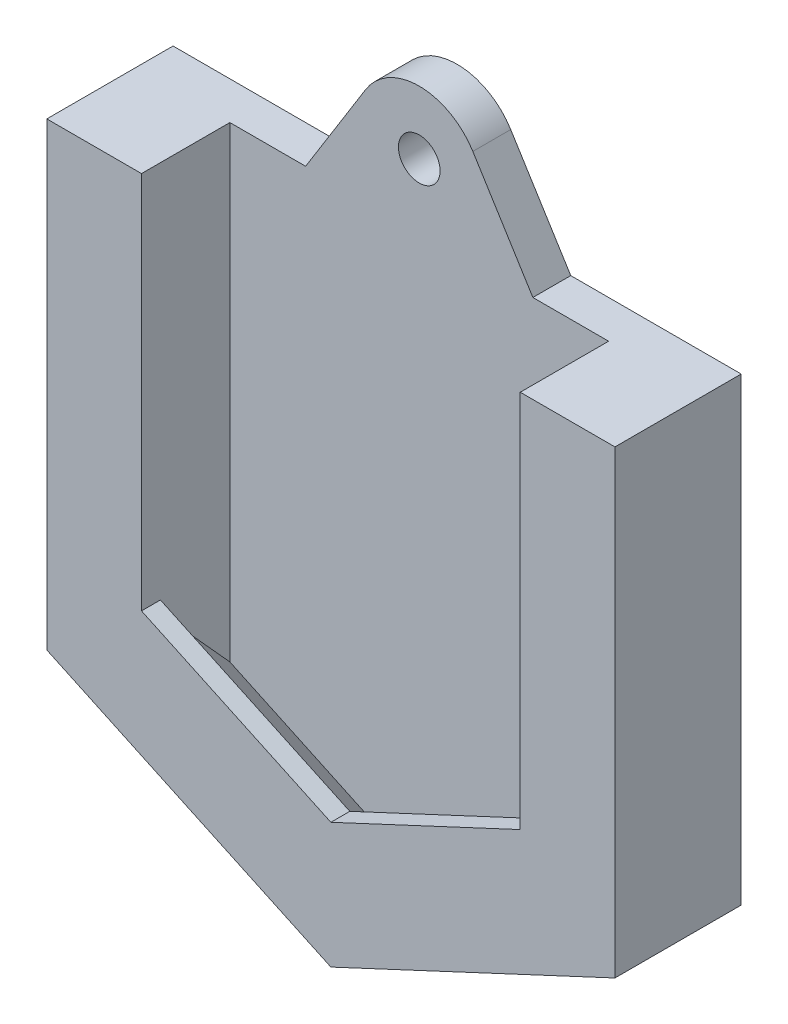
ISO-10303-21;
HEADER;
FILE_DESCRIPTION(('STEP AP214'),'2;1');
FILE_NAME('part.step','',(''),(''),'','','');
FILE_SCHEMA(('AUTOMOTIVE_DESIGN { 1 0 10303 214 1 1 1 1 }'));
ENDSEC;
DATA;
#1=APPLICATION_CONTEXT('core data for automotive mechanical design processes');
#2=APPLICATION_PROTOCOL_DEFINITION('international standard','automotive_design',2000,#1);
#3=PRODUCT_CONTEXT('',#1,'mechanical');
#4=PRODUCT('Part','Part','',(#3));
#5=PRODUCT_RELATED_PRODUCT_CATEGORY('part','',(#4));
#6=PRODUCT_DEFINITION_FORMATION('','',#4);
#7=PRODUCT_DEFINITION_CONTEXT('part definition',#1,'design');
#8=PRODUCT_DEFINITION('design','',#6,#7);
#9=PRODUCT_DEFINITION_SHAPE('','',#8);
#10=(LENGTH_UNIT() NAMED_UNIT(*) SI_UNIT(.MILLI.,.METRE.));
#11=(NAMED_UNIT(*) PLANE_ANGLE_UNIT() SI_UNIT($,.RADIAN.));
#12=(NAMED_UNIT(*) SI_UNIT($,.STERADIAN.) SOLID_ANGLE_UNIT());
#13=UNCERTAINTY_MEASURE_WITH_UNIT(LENGTH_MEASURE(1.E-05),#10,'distance_accuracy_value','');
#14=(GEOMETRIC_REPRESENTATION_CONTEXT(3) GLOBAL_UNCERTAINTY_ASSIGNED_CONTEXT((#13)) GLOBAL_UNIT_ASSIGNED_CONTEXT((#10,
#11,#12)) REPRESENTATION_CONTEXT('',''));
#15=CARTESIAN_POINT('',(0.,0.,0.));
#16=DIRECTION('',(0.,0.,1.));
#17=DIRECTION('',(1.,0.,0.));
#18=AXIS2_PLACEMENT_3D('',#15,#16,#17);
#19=CARTESIAN_POINT('',(-22.5,25.,10.));
#20=DIRECTION('',(0.,-1.,0.));
#21=DIRECTION('',(0.,0.,-1.));
#22=AXIS2_PLACEMENT_3D('',#19,#20,#21);
#23=PLANE('',#22);
#24=DIRECTION('',(0.,0.,-1.));
#25=VECTOR('',#24,1.);
#26=CARTESIAN_POINT('',(9.,25.,3.));
#27=LINE('',#26,#25);
#28=CARTESIAN_POINT('',(9.,25.,3.));
#29=VERTEX_POINT('',#28);
#30=CARTESIAN_POINT('',(9.,25.,0.));
#31=VERTEX_POINT('',#30);
#32=EDGE_CURVE('E314',#29,#31,#27,.T.);
#33=ORIENTED_EDGE('',*,*,#32,.F.);
#34=DIRECTION('',(-1.,0.,0.));
#35=VECTOR('',#34,1.);
#36=CARTESIAN_POINT('',(-15.,25.,3.));
#37=LINE('',#36,#35);
#38=CARTESIAN_POINT('',(15.,25.,3.));
#39=VERTEX_POINT('',#38);
#40=EDGE_CURVE('E224',#39,#29,#37,.T.);
#41=ORIENTED_EDGE('',*,*,#40,.F.);
#42=DIRECTION('',(0.,0.,1.));
#43=VECTOR('',#42,1.);
#44=CARTESIAN_POINT('',(15.,25.,3.));
#45=LINE('',#44,#43);
#46=CARTESIAN_POINT('',(15.,25.,10.));
#47=VERTEX_POINT('',#46);
#48=EDGE_CURVE('E223',#39,#47,#45,.T.);
#49=ORIENTED_EDGE('',*,*,#48,.T.);
#50=DIRECTION('',(-1.,0.,0.));
#51=VECTOR('',#50,1.);
#52=CARTESIAN_POINT('',(-22.5,25.,10.));
#53=LINE('',#52,#51);
#54=CARTESIAN_POINT('',(22.5,25.,10.));
#55=VERTEX_POINT('',#54);
#56=EDGE_CURVE('E264',#55,#47,#53,.T.);
#57=ORIENTED_EDGE('',*,*,#56,.F.);
#58=DIRECTION('',(0.,0.,-1.));
#59=VECTOR('',#58,1.);
#60=CARTESIAN_POINT('',(22.5,25.,10.));
#61=LINE('',#60,#59);
#62=CARTESIAN_POINT('',(22.5,25.,0.));
#63=VERTEX_POINT('',#62);
#64=EDGE_CURVE('E192',#55,#63,#61,.T.);
#65=ORIENTED_EDGE('',*,*,#64,.T.);
#66=DIRECTION('',(-1.,0.,0.));
#67=VECTOR('',#66,1.);
#68=CARTESIAN_POINT('',(-22.5,25.,0.));
#69=LINE('',#68,#67);
#70=EDGE_CURVE('E174',#63,#31,#69,.T.);
#71=ORIENTED_EDGE('',*,*,#70,.T.);
#72=EDGE_LOOP('',(#33,#41,#49,#57,#65,#71));
#73=FACE_BOUND('',#72,.T.);
#74=ADVANCED_FACE('F33',(#73),#23,.F.);
#75=CARTESIAN_POINT('',(22.5,25.,10.));
#76=DIRECTION('',(-1.,0.,0.));
#77=DIRECTION('',(0.,-1.,0.));
#78=AXIS2_PLACEMENT_3D('',#75,#76,#77);
#79=PLANE('',#78);
#80=DIRECTION('',(0.,1.,0.));
#81=VECTOR('',#80,1.);
#82=CARTESIAN_POINT('',(22.5,25.,10.));
#83=LINE('',#82,#81);
#84=CARTESIAN_POINT('',(22.5,-11.4317672143481,10.));
#85=VERTEX_POINT('',#84);
#86=EDGE_CURVE('E168',#85,#55,#83,.T.);
#87=ORIENTED_EDGE('',*,*,#86,.F.);
#88=DIRECTION('',(0.,0.,1.));
#89=VECTOR('',#88,1.);
#90=CARTESIAN_POINT('',(22.5,-11.4317672143481,0.));
#91=LINE('',#90,#89);
#92=CARTESIAN_POINT('',(22.5,-11.4317672143481,0.));
#93=VERTEX_POINT('',#92);
#94=EDGE_CURVE('E155',#93,#85,#91,.T.);
#95=ORIENTED_EDGE('',*,*,#94,.F.);
#96=DIRECTION('',(0.,1.,0.));
#97=VECTOR('',#96,1.);
#98=CARTESIAN_POINT('',(22.5,25.,0.));
#99=LINE('',#98,#97);
#100=EDGE_CURVE('E166',#93,#63,#99,.T.);
#101=ORIENTED_EDGE('',*,*,#100,.T.);
#102=ORIENTED_EDGE('',*,*,#64,.F.);
#103=EDGE_LOOP('',(#87,#95,#101,#102));
#104=FACE_BOUND('',#103,.T.);
#105=ADVANCED_FACE('F164',(#104),#79,.F.);
#106=CARTESIAN_POINT('',(-9.,25.,3.));
#107=VERTEX_POINT('',#106);
#108=CARTESIAN_POINT('',(-15.,25.,3.));
#109=VERTEX_POINT('',#108);
#110=EDGE_CURVE('E222',#107,#109,#37,.T.);
#111=ORIENTED_EDGE('',*,*,#110,.F.);
#112=DIRECTION('',(0.,0.,-1.));
#113=VECTOR('',#112,1.);
#114=CARTESIAN_POINT('',(-9.,25.,3.));
#115=LINE('',#114,#113);
#116=CARTESIAN_POINT('',(-9.,25.,0.));
#117=VERTEX_POINT('',#116);
#118=EDGE_CURVE('E312',#107,#117,#115,.T.);
#119=ORIENTED_EDGE('',*,*,#118,.T.);
#120=CARTESIAN_POINT('',(-22.5,25.,0.));
#121=VERTEX_POINT('',#120);
#122=EDGE_CURVE('E176',#117,#121,#69,.T.);
#123=ORIENTED_EDGE('',*,*,#122,.T.);
#124=DIRECTION('',(0.,0.,-1.));
#125=VECTOR('',#124,1.);
#126=CARTESIAN_POINT('',(-22.5,25.,10.));
#127=LINE('',#126,#125);
#128=CARTESIAN_POINT('',(-22.5,25.,10.));
#129=VERTEX_POINT('',#128);
#130=EDGE_CURVE('E189',#129,#121,#127,.T.);
#131=ORIENTED_EDGE('',*,*,#130,.F.);
#132=CARTESIAN_POINT('',(-15.,25.,10.));
#133=VERTEX_POINT('',#132);
#134=EDGE_CURVE('E263',#133,#129,#53,.T.);
#135=ORIENTED_EDGE('',*,*,#134,.F.);
#136=DIRECTION('',(0.,0.,1.));
#137=VECTOR('',#136,1.);
#138=CARTESIAN_POINT('',(-15.,25.,3.));
#139=LINE('',#138,#137);
#140=EDGE_CURVE('E259',#109,#133,#139,.T.);
#141=ORIENTED_EDGE('',*,*,#140,.F.);
#142=EDGE_LOOP('',(#111,#119,#123,#131,#135,#141));
#143=FACE_BOUND('',#142,.T.);
#144=ADVANCED_FACE('F278',(#143),#23,.F.);
#145=CARTESIAN_POINT('',(-22.5,25.,10.));
#146=DIRECTION('',(1.,0.,0.));
#147=DIRECTION('',(0.,1.,0.));
#148=AXIS2_PLACEMENT_3D('',#145,#146,#147);
#149=PLANE('',#148);
#150=DIRECTION('',(0.,-1.,0.));
#151=VECTOR('',#150,1.);
#152=CARTESIAN_POINT('',(-22.5,25.,0.));
#153=LINE('',#152,#151);
#154=CARTESIAN_POINT('',(-22.5,-11.4317672143481,0.));
#155=VERTEX_POINT('',#154);
#156=EDGE_CURVE('E186',#121,#155,#153,.T.);
#157=ORIENTED_EDGE('',*,*,#156,.T.);
#158=DIRECTION('',(0.,0.,1.));
#159=VECTOR('',#158,1.);
#160=CARTESIAN_POINT('',(-22.5,-11.4317672143481,0.));
#161=LINE('',#160,#159);
#162=CARTESIAN_POINT('',(-22.5,-11.4317672143481,10.));
#163=VERTEX_POINT('',#162);
#164=EDGE_CURVE('E284',#155,#163,#161,.T.);
#165=ORIENTED_EDGE('',*,*,#164,.T.);
#166=DIRECTION('',(0.,-1.,0.));
#167=VECTOR('',#166,1.);
#168=CARTESIAN_POINT('',(-22.5,25.,10.));
#169=LINE('',#168,#167);
#170=EDGE_CURVE('E183',#129,#163,#169,.T.);
#171=ORIENTED_EDGE('',*,*,#170,.F.);
#172=ORIENTED_EDGE('',*,*,#130,.T.);
#173=EDGE_LOOP('',(#157,#165,#171,#172));
#174=FACE_BOUND('',#173,.T.);
#175=ADVANCED_FACE('F283',(#174),#149,.F.);
#176=CARTESIAN_POINT('',(0.,0.,10.));
#177=DIRECTION('',(0.,0.,1.));
#178=DIRECTION('',(1.,0.,0.));
#179=AXIS2_PLACEMENT_3D('',#176,#177,#178);
#180=PLANE('',#179);
#181=DIRECTION('',(-0.906183139995265,0.422885465331124,0.));
#182=VECTOR('',#181,1.);
#183=CARTESIAN_POINT('',(-22.5,-11.4317672143481,10.));
#184=LINE('',#183,#182);
#185=CARTESIAN_POINT('',(0.,-21.9317672143481,10.));
#186=VERTEX_POINT('',#185);
#187=EDGE_CURVE('E160',#186,#163,#184,.T.);
#188=ORIENTED_EDGE('',*,*,#187,.F.);
#189=DIRECTION('',(-0.906183139995265,-0.422885465331124,0.));
#190=VECTOR('',#189,1.);
#191=CARTESIAN_POINT('',(0.,-21.9317672143481,10.));
#192=LINE('',#191,#190);
#193=EDGE_CURVE('E338',#85,#186,#192,.T.);
#194=ORIENTED_EDGE('',*,*,#193,.F.);
#195=ORIENTED_EDGE('',*,*,#86,.T.);
#196=ORIENTED_EDGE('',*,*,#56,.T.);
#197=DIRECTION('',(0.,1.,0.));
#198=VECTOR('',#197,1.);
#199=CARTESIAN_POINT('',(15.,-5.,10.));
#200=LINE('',#199,#198);
#201=CARTESIAN_POINT('',(15.,-5.,10.));
#202=VERTEX_POINT('',#201);
#203=EDGE_CURVE('E240',#202,#47,#200,.T.);
#204=ORIENTED_EDGE('',*,*,#203,.F.);
#205=DIRECTION('',(0.906183139995265,0.422885465331124,0.));
#206=VECTOR('',#205,1.);
#207=CARTESIAN_POINT('',(0.,-12.,10.));
#208=LINE('',#207,#206);
#209=CARTESIAN_POINT('',(0.,-12.,10.));
#210=VERTEX_POINT('',#209);
#211=EDGE_CURVE('E244',#210,#202,#208,.T.);
#212=ORIENTED_EDGE('',*,*,#211,.F.);
#213=DIRECTION('',(0.906183139995265,-0.422885465331124,0.));
#214=VECTOR('',#213,1.);
#215=CARTESIAN_POINT('',(-15.,-5.,10.));
#216=LINE('',#215,#214);
#217=CARTESIAN_POINT('',(-15.,-5.,10.));
#218=VERTEX_POINT('',#217);
#219=EDGE_CURVE('E251',#218,#210,#216,.T.);
#220=ORIENTED_EDGE('',*,*,#219,.F.);
#221=DIRECTION('',(0.,-1.,0.));
#222=VECTOR('',#221,1.);
#223=CARTESIAN_POINT('',(-15.,-5.,10.));
#224=LINE('',#223,#222);
#225=EDGE_CURVE('E248',#133,#218,#224,.T.);
#226=ORIENTED_EDGE('',*,*,#225,.F.);
#227=ORIENTED_EDGE('',*,*,#134,.T.);
#228=ORIENTED_EDGE('',*,*,#170,.T.);
#229=EDGE_LOOP('',(#188,#194,#195,#196,#204,#212,#220,#226,#227,#228));
#230=FACE_BOUND('',#229,.T.);
#231=ADVANCED_FACE('F274',(#230),#180,.T.);
#232=CARTESIAN_POINT('',(0.,0.,0.));
#233=DIRECTION('',(0.,0.,1.));
#234=DIRECTION('',(1.,0.,0.));
#235=AXIS2_PLACEMENT_3D('',#232,#233,#234);
#236=PLANE('',#235);
#237=DIRECTION('',(-0.906183139995265,-0.422885465331124,0.));
#238=VECTOR('',#237,1.);
#239=CARTESIAN_POINT('',(0.,-21.9317672143481,0.));
#240=LINE('',#239,#238);
#241=CARTESIAN_POINT('',(0.,-21.9317672143481,0.));
#242=VERTEX_POINT('',#241);
#243=EDGE_CURVE('E151',#93,#242,#240,.T.);
#244=ORIENTED_EDGE('',*,*,#243,.T.);
#245=DIRECTION('',(-0.906183139995265,0.422885465331124,0.));
#246=VECTOR('',#245,1.);
#247=CARTESIAN_POINT('',(-22.5,-11.4317672143481,0.));
#248=LINE('',#247,#246);
#249=EDGE_CURVE('E49',#242,#155,#248,.T.);
#250=ORIENTED_EDGE('',*,*,#249,.T.);
#251=ORIENTED_EDGE('',*,*,#156,.F.);
#252=ORIENTED_EDGE('',*,*,#122,.F.);
#253=DIRECTION('',(0.528301886792453,0.849056603773585,0.));
#254=VECTOR('',#253,1.);
#255=CARTESIAN_POINT('',(-4.24528301886792,32.6415094339623,0.));
#256=LINE('',#255,#254);
#257=CARTESIAN_POINT('',(-4.24528301886792,32.6415094339623,0.));
#258=VERTEX_POINT('',#257);
#259=EDGE_CURVE('E57',#117,#258,#256,.T.);
#260=ORIENTED_EDGE('',*,*,#259,.T.);
#261=CARTESIAN_POINT('',(0.,30.,0.));
#262=DIRECTION('',(0.,0.,-1.));
#263=DIRECTION('',(-1.,0.,0.));
#264=AXIS2_PLACEMENT_3D('',#261,#262,#263);
#265=CIRCLE('',#264,5.);
#266=CARTESIAN_POINT('',(4.24528301886792,32.6415094339623,0.));
#267=VERTEX_POINT('',#266);
#268=EDGE_CURVE('E295',#258,#267,#265,.T.);
#269=ORIENTED_EDGE('',*,*,#268,.T.);
#270=DIRECTION('',(0.528301886792453,-0.849056603773585,0.));
#271=VECTOR('',#270,1.);
#272=CARTESIAN_POINT('',(9.,25.,0.));
#273=LINE('',#272,#271);
#274=EDGE_CURVE('E308',#267,#31,#273,.T.);
#275=ORIENTED_EDGE('',*,*,#274,.T.);
#276=ORIENTED_EDGE('',*,*,#70,.F.);
#277=ORIENTED_EDGE('',*,*,#100,.F.);
#278=EDGE_LOOP('',(#244,#250,#251,#252,#260,#269,#275,#276,#277));
#279=FACE_BOUND('',#278,.T.);
#280=CARTESIAN_POINT('',(0.,30.,0.));
#281=DIRECTION('',(0.,0.,-1.));
#282=DIRECTION('',(-1.,0.,0.));
#283=AXIS2_PLACEMENT_3D('',#280,#281,#282);
#284=CIRCLE('',#283,1.65);
#285=CARTESIAN_POINT('',(-1.65,30.,0.));
#286=VERTEX_POINT('',#285);
#287=EDGE_CURVE('E285',#286,#286,#284,.T.);
#288=ORIENTED_EDGE('',*,*,#287,.F.);
#289=EDGE_LOOP('',(#288));
#290=FACE_BOUND('',#289,.T.);
#291=ADVANCED_FACE('F170',(#279,#290),#236,.F.);
#292=CARTESIAN_POINT('',(15.,-5.,3.));
#293=DIRECTION('',(1.,0.,0.));
#294=DIRECTION('',(0.,0.,-1.));
#295=AXIS2_PLACEMENT_3D('',#292,#293,#294);
#296=PLANE('',#295);
#297=DIRECTION('',(0.,1.,0.));
#298=VECTOR('',#297,1.);
#299=CARTESIAN_POINT('',(15.,-5.,3.));
#300=LINE('',#299,#298);
#301=CARTESIAN_POINT('',(15.,-12.,3.));
#302=VERTEX_POINT('',#301);
#303=EDGE_CURVE('E241',#302,#39,#300,.T.);
#304=ORIENTED_EDGE('',*,*,#303,.F.);
#305=DIRECTION('',(0.,0.741011603413051,0.671492221553772));
#306=VECTOR('',#305,1.);
#307=CARTESIAN_POINT('',(15.,-15.8436873747495,-0.483084694410695));
#308=LINE('',#307,#306);
#309=CARTESIAN_POINT('',(15.,-5.93058670234285,8.5));
#310=VERTEX_POINT('',#309);
#311=EDGE_CURVE('E11',#302,#310,#308,.T.);
#312=ORIENTED_EDGE('',*,*,#311,.T.);
#313=DIRECTION('',(0.,1.,0.));
#314=VECTOR('',#313,1.);
#315=CARTESIAN_POINT('',(15.,-12.,8.5));
#316=LINE('',#315,#314);
#317=CARTESIAN_POINT('',(15.,-5.,8.5));
#318=VERTEX_POINT('',#317);
#319=EDGE_CURVE('E234',#310,#318,#316,.T.);
#320=ORIENTED_EDGE('',*,*,#319,.T.);
#321=DIRECTION('',(0.,0.,1.));
#322=VECTOR('',#321,1.);
#323=CARTESIAN_POINT('',(15.,-5.,3.));
#324=LINE('',#323,#322);
#325=EDGE_CURVE('E177',#318,#202,#324,.T.);
#326=ORIENTED_EDGE('',*,*,#325,.T.);
#327=ORIENTED_EDGE('',*,*,#203,.T.);
#328=ORIENTED_EDGE('',*,*,#48,.F.);
#329=EDGE_LOOP('',(#304,#312,#320,#326,#327,#328));
#330=FACE_BOUND('',#329,.T.);
#331=ADVANCED_FACE('F319',(#330),#296,.F.);
#332=CARTESIAN_POINT('',(0.,-12.,3.));
#333=DIRECTION('',(0.422885465331124,-0.906183139995266,0.));
#334=DIRECTION('',(0.906183139995266,0.422885465331124,0.));
#335=AXIS2_PLACEMENT_3D('',#332,#333,#334);
#336=PLANE('',#335);
#337=ORIENTED_EDGE('',*,*,#325,.F.);
#338=DIRECTION('',(-0.906183139995266,-0.422885465331124,0.));
#339=VECTOR('',#338,1.);
#340=CARTESIAN_POINT('',(0.,-12.,8.5));
#341=LINE('',#340,#339);
#342=CARTESIAN_POINT('',(0.,-12.,8.5));
#343=VERTEX_POINT('',#342);
#344=EDGE_CURVE('E237',#318,#343,#341,.T.);
#345=ORIENTED_EDGE('',*,*,#344,.T.);
#346=DIRECTION('',(0.,0.,1.));
#347=VECTOR('',#346,1.);
#348=CARTESIAN_POINT('',(0.,-12.,3.));
#349=LINE('',#348,#347);
#350=EDGE_CURVE('E180',#343,#210,#349,.T.);
#351=ORIENTED_EDGE('',*,*,#350,.T.);
#352=ORIENTED_EDGE('',*,*,#211,.T.);
#353=EDGE_LOOP('',(#337,#345,#351,#352));
#354=FACE_BOUND('',#353,.T.);
#355=ADVANCED_FACE('F327',(#354),#336,.F.);
#356=CARTESIAN_POINT('',(-15.,-5.,3.));
#357=DIRECTION('',(-0.422885465331124,-0.906183139995265,0.));
#358=DIRECTION('',(0.906183139995266,-0.422885465331124,0.));
#359=AXIS2_PLACEMENT_3D('',#356,#357,#358);
#360=PLANE('',#359);
#361=ORIENTED_EDGE('',*,*,#350,.F.);
#362=DIRECTION('',(-0.906183139995266,0.422885465331124,0.));
#363=VECTOR('',#362,1.);
#364=CARTESIAN_POINT('',(-15.,-5.,8.5));
#365=LINE('',#364,#363);
#366=CARTESIAN_POINT('',(-15.,-5.,8.5));
#367=VERTEX_POINT('',#366);
#368=EDGE_CURVE('E194',#343,#367,#365,.T.);
#369=ORIENTED_EDGE('',*,*,#368,.T.);
#370=DIRECTION('',(0.,0.,1.));
#371=VECTOR('',#370,1.);
#372=CARTESIAN_POINT('',(-15.,-5.,3.));
#373=LINE('',#372,#371);
#374=EDGE_CURVE('E257',#367,#218,#373,.T.);
#375=ORIENTED_EDGE('',*,*,#374,.T.);
#376=ORIENTED_EDGE('',*,*,#219,.T.);
#377=EDGE_LOOP('',(#361,#369,#375,#376));
#378=FACE_BOUND('',#377,.T.);
#379=ADVANCED_FACE('F336',(#378),#360,.F.);
#380=CARTESIAN_POINT('',(-15.,-5.,3.));
#381=DIRECTION('',(-1.,0.,0.));
#382=DIRECTION('',(0.,0.,1.));
#383=AXIS2_PLACEMENT_3D('',#380,#381,#382);
#384=PLANE('',#383);
#385=DIRECTION('',(0.,-1.,0.));
#386=VECTOR('',#385,1.);
#387=CARTESIAN_POINT('',(-15.,-5.,8.5));
#388=LINE('',#387,#386);
#389=CARTESIAN_POINT('',(-15.,-5.93058670234284,8.5));
#390=VERTEX_POINT('',#389);
#391=EDGE_CURVE('E210',#367,#390,#388,.T.);
#392=ORIENTED_EDGE('',*,*,#391,.T.);
#393=DIRECTION('',(0.,-0.741011603413051,-0.671492221553771));
#394=VECTOR('',#393,1.);
#395=CARTESIAN_POINT('',(-15.,-12.,2.99999999999997));
#396=LINE('',#395,#394);
#397=CARTESIAN_POINT('',(-15.,-12.,3.));
#398=VERTEX_POINT('',#397);
#399=EDGE_CURVE('E42',#390,#398,#396,.T.);
#400=ORIENTED_EDGE('',*,*,#399,.T.);
#401=DIRECTION('',(0.,-1.,0.));
#402=VECTOR('',#401,1.);
#403=CARTESIAN_POINT('',(-15.,-5.,3.));
#404=LINE('',#403,#402);
#405=EDGE_CURVE('E207',#109,#398,#404,.T.);
#406=ORIENTED_EDGE('',*,*,#405,.F.);
#407=ORIENTED_EDGE('',*,*,#140,.T.);
#408=ORIENTED_EDGE('',*,*,#225,.T.);
#409=ORIENTED_EDGE('',*,*,#374,.F.);
#410=EDGE_LOOP('',(#392,#400,#406,#407,#408,#409));
#411=FACE_BOUND('',#410,.T.);
#412=ADVANCED_FACE('F206',(#411),#384,.F.);
#413=CARTESIAN_POINT('',(0.,0.,3.));
#414=DIRECTION('',(0.,0.,-1.));
#415=DIRECTION('',(-1.,0.,0.));
#416=AXIS2_PLACEMENT_3D('',#413,#414,#415);
#417=PLANE('',#416);
#418=DIRECTION('',(0.906183139995265,0.422885465331124,0.));
#419=VECTOR('',#418,1.);
#420=CARTESIAN_POINT('',(0.,-19.,3.));
#421=LINE('',#420,#419);
#422=CARTESIAN_POINT('',(0.,-19.,3.));
#423=VERTEX_POINT('',#422);
#424=EDGE_CURVE('E229',#423,#302,#421,.T.);
#425=ORIENTED_EDGE('',*,*,#424,.T.);
#426=ORIENTED_EDGE('',*,*,#303,.T.);
#427=ORIENTED_EDGE('',*,*,#40,.T.);
#428=DIRECTION('',(0.528301886792453,-0.849056603773585,0.));
#429=VECTOR('',#428,1.);
#430=CARTESIAN_POINT('',(9.,25.,3.));
#431=LINE('',#430,#429);
#432=CARTESIAN_POINT('',(4.24528301886792,32.6415094339623,3.));
#433=VERTEX_POINT('',#432);
#434=EDGE_CURVE('E300',#433,#29,#431,.T.);
#435=ORIENTED_EDGE('',*,*,#434,.F.);
#436=CARTESIAN_POINT('',(0.,30.,3.));
#437=DIRECTION('',(0.,0.,-1.));
#438=DIRECTION('',(-1.,0.,0.));
#439=AXIS2_PLACEMENT_3D('',#436,#437,#438);
#440=CIRCLE('',#439,5.);
#441=CARTESIAN_POINT('',(-4.24528301886792,32.6415094339623,3.));
#442=VERTEX_POINT('',#441);
#443=EDGE_CURVE('E297',#442,#433,#440,.T.);
#444=ORIENTED_EDGE('',*,*,#443,.F.);
#445=DIRECTION('',(0.528301886792453,0.849056603773585,0.));
#446=VECTOR('',#445,1.);
#447=CARTESIAN_POINT('',(-4.24528301886792,32.6415094339623,3.));
#448=LINE('',#447,#446);
#449=EDGE_CURVE('E302',#107,#442,#448,.T.);
#450=ORIENTED_EDGE('',*,*,#449,.F.);
#451=ORIENTED_EDGE('',*,*,#110,.T.);
#452=ORIENTED_EDGE('',*,*,#405,.T.);
#453=DIRECTION('',(0.906183139995265,-0.422885465331124,0.));
#454=VECTOR('',#453,1.);
#455=CARTESIAN_POINT('',(-15.,-12.,3.));
#456=LINE('',#455,#454);
#457=EDGE_CURVE('E219',#398,#423,#456,.T.);
#458=ORIENTED_EDGE('',*,*,#457,.T.);
#459=EDGE_LOOP('',(#425,#426,#427,#435,#444,#450,#451,#452,#458));
#460=FACE_BOUND('',#459,.T.);
#461=CARTESIAN_POINT('',(0.,30.,3.));
#462=DIRECTION('',(0.,0.,-1.));
#463=DIRECTION('',(-1.,0.,0.));
#464=AXIS2_PLACEMENT_3D('',#461,#462,#463);
#465=CIRCLE('',#464,1.65);
#466=CARTESIAN_POINT('',(-1.65,30.,3.));
#467=VERTEX_POINT('',#466);
#468=EDGE_CURVE('E288',#467,#467,#465,.T.);
#469=ORIENTED_EDGE('',*,*,#468,.T.);
#470=EDGE_LOOP('',(#469));
#471=FACE_BOUND('',#470,.T.);
#472=ADVANCED_FACE('F217',(#460,#471),#417,.F.);
#473=CARTESIAN_POINT('',(0.,0.,8.5));
#474=DIRECTION('',(0.,0.,1.));
#475=DIRECTION('',(1.,0.,0.));
#476=AXIS2_PLACEMENT_3D('',#473,#474,#475);
#477=PLANE('',#476);
#478=DIRECTION('',(-0.906183139995266,-0.422885465331124,0.));
#479=VECTOR('',#478,1.);
#480=CARTESIAN_POINT('',(4.95515183848905,-10.618182511048,8.5));
#481=LINE('',#480,#479);
#482=CARTESIAN_POINT('',(0.,-12.9305867023428,8.5));
#483=VERTEX_POINT('',#482);
#484=EDGE_CURVE('E197',#310,#483,#481,.T.);
#485=ORIENTED_EDGE('',*,*,#484,.T.);
#486=DIRECTION('',(-0.906183139995266,0.422885465331124,0.));
#487=VECTOR('',#486,1.);
#488=CARTESIAN_POINT('',(-4.95515183848905,-10.618182511048,8.5));
#489=LINE('',#488,#487);
#490=EDGE_CURVE('E199',#483,#390,#489,.T.);
#491=ORIENTED_EDGE('',*,*,#490,.T.);
#492=ORIENTED_EDGE('',*,*,#391,.F.);
#493=ORIENTED_EDGE('',*,*,#368,.F.);
#494=ORIENTED_EDGE('',*,*,#344,.F.);
#495=ORIENTED_EDGE('',*,*,#319,.F.);
#496=EDGE_LOOP('',(#485,#491,#492,#493,#494,#495));
#497=FACE_BOUND('',#496,.T.);
#498=ADVANCED_FACE('F324',(#497),#477,.F.);
#499=CARTESIAN_POINT('',(0.,-19.,2.99999999999997));
#500=DIRECTION('',(0.299025180200868,-0.640768243287574,0.707106781186544));
#501=DIRECTION('',(0.906183139995265,0.422885465331124,0.));
#502=AXIS2_PLACEMENT_3D('',#499,#500,#501);
#503=PLANE('',#502);
#504=ORIENTED_EDGE('',*,*,#311,.F.);
#505=ORIENTED_EDGE('',*,*,#424,.F.);
#506=DIRECTION('',(0.,0.741011603413051,0.671492221553772));
#507=VECTOR('',#506,1.);
#508=CARTESIAN_POINT('',(0.,-15.1563126252505,6.48308469441063));
#509=LINE('',#508,#507);
#510=EDGE_CURVE('E37',#483,#423,#509,.F.);
#511=ORIENTED_EDGE('',*,*,#510,.F.);
#512=ORIENTED_EDGE('',*,*,#484,.F.);
#513=EDGE_LOOP('',(#504,#505,#511,#512));
#514=FACE_BOUND('',#513,.T.);
#515=ADVANCED_FACE('F35',(#514),#503,.F.);
#516=CARTESIAN_POINT('',(-15.,-12.,2.99999999999997));
#517=DIRECTION('',(-0.299025180200868,-0.640768243287574,0.707106781186544));
#518=DIRECTION('',(0.906183139995265,-0.422885465331124,0.));
#519=AXIS2_PLACEMENT_3D('',#516,#517,#518);
#520=PLANE('',#519);
#521=ORIENTED_EDGE('',*,*,#399,.F.);
#522=ORIENTED_EDGE('',*,*,#490,.F.);
#523=ORIENTED_EDGE('',*,*,#510,.T.);
#524=ORIENTED_EDGE('',*,*,#457,.F.);
#525=EDGE_LOOP('',(#521,#522,#523,#524));
#526=FACE_BOUND('',#525,.T.);
#527=ADVANCED_FACE('F226',(#526),#520,.F.);
#528=CARTESIAN_POINT('',(0.,30.,3.));
#529=DIRECTION('',(0.,0.,-1.));
#530=DIRECTION('',(-1.,0.,0.));
#531=AXIS2_PLACEMENT_3D('',#528,#529,#530);
#532=CYLINDRICAL_SURFACE('',#531,5.);
#533=ORIENTED_EDGE('',*,*,#268,.F.);
#534=DIRECTION('',(0.,0.,-1.));
#535=VECTOR('',#534,1.);
#536=CARTESIAN_POINT('',(-4.24528301886792,32.6415094339623,3.));
#537=LINE('',#536,#535);
#538=EDGE_CURVE('E232',#442,#258,#537,.T.);
#539=ORIENTED_EDGE('',*,*,#538,.F.);
#540=ORIENTED_EDGE('',*,*,#443,.T.);
#541=DIRECTION('',(0.,0.,-1.));
#542=VECTOR('',#541,1.);
#543=CARTESIAN_POINT('',(4.24528301886792,32.6415094339623,3.));
#544=LINE('',#543,#542);
#545=EDGE_CURVE('E305',#433,#267,#544,.T.);
#546=ORIENTED_EDGE('',*,*,#545,.T.);
#547=EDGE_LOOP('',(#533,#539,#540,#546));
#548=FACE_BOUND('',#547,.T.);
#549=ADVANCED_FACE('F381',(#548),#532,.T.);
#550=CARTESIAN_POINT('',(-4.24528301886792,32.6415094339623,3.));
#551=DIRECTION('',(-0.849056603773585,0.528301886792453,0.));
#552=DIRECTION('',(-0.528301886792453,-0.849056603773585,0.));
#553=AXIS2_PLACEMENT_3D('',#550,#551,#552);
#554=PLANE('',#553);
#555=ORIENTED_EDGE('',*,*,#259,.F.);
#556=ORIENTED_EDGE('',*,*,#118,.F.);
#557=ORIENTED_EDGE('',*,*,#449,.T.);
#558=ORIENTED_EDGE('',*,*,#538,.T.);
#559=EDGE_LOOP('',(#555,#556,#557,#558));
#560=FACE_BOUND('',#559,.T.);
#561=ADVANCED_FACE('F384',(#560),#554,.T.);
#562=CARTESIAN_POINT('',(9.,25.,3.));
#563=DIRECTION('',(0.849056603773585,0.528301886792453,0.));
#564=DIRECTION('',(-0.528301886792453,0.849056603773585,0.));
#565=AXIS2_PLACEMENT_3D('',#562,#563,#564);
#566=PLANE('',#565);
#567=ORIENTED_EDGE('',*,*,#274,.F.);
#568=ORIENTED_EDGE('',*,*,#545,.F.);
#569=ORIENTED_EDGE('',*,*,#434,.T.);
#570=ORIENTED_EDGE('',*,*,#32,.T.);
#571=EDGE_LOOP('',(#567,#568,#569,#570));
#572=FACE_BOUND('',#571,.T.);
#573=ADVANCED_FACE('F348',(#572),#566,.T.);
#574=CARTESIAN_POINT('',(0.,30.,3.));
#575=DIRECTION('',(0.,0.,-1.));
#576=DIRECTION('',(-1.,0.,0.));
#577=AXIS2_PLACEMENT_3D('',#574,#575,#576);
#578=CYLINDRICAL_SURFACE('',#577,1.65);
#579=ORIENTED_EDGE('',*,*,#468,.F.);
#580=EDGE_LOOP('',(#579));
#581=FACE_BOUND('',#580,.T.);
#582=ORIENTED_EDGE('',*,*,#287,.T.);
#583=EDGE_LOOP('',(#582));
#584=FACE_BOUND('',#583,.T.);
#585=ADVANCED_FACE('F341',(#581,#584),#578,.F.);
#586=CARTESIAN_POINT('',(-22.5,-11.4317672143481,0.));
#587=DIRECTION('',(0.422885465331124,0.906183139995265,0.));
#588=DIRECTION('',(-0.906183139995265,0.422885465331124,0.));
#589=AXIS2_PLACEMENT_3D('',#586,#587,#588);
#590=PLANE('',#589);
#591=ORIENTED_EDGE('',*,*,#187,.T.);
#592=ORIENTED_EDGE('',*,*,#164,.F.);
#593=ORIENTED_EDGE('',*,*,#249,.F.);
#594=DIRECTION('',(0.,0.,1.));
#595=VECTOR('',#594,1.);
#596=CARTESIAN_POINT('',(0.,-21.9317672143481,0.));
#597=LINE('',#596,#595);
#598=EDGE_CURVE('E157',#242,#186,#597,.T.);
#599=ORIENTED_EDGE('',*,*,#598,.T.);
#600=EDGE_LOOP('',(#591,#592,#593,#599));
#601=FACE_BOUND('',#600,.T.);
#602=ADVANCED_FACE('F339',(#601),#590,.F.);
#603=CARTESIAN_POINT('',(0.,-21.9317672143481,0.));
#604=DIRECTION('',(-0.422885465331124,0.906183139995265,0.));
#605=DIRECTION('',(-0.906183139995265,-0.422885465331124,0.));
#606=AXIS2_PLACEMENT_3D('',#603,#604,#605);
#607=PLANE('',#606);
#608=ORIENTED_EDGE('',*,*,#193,.T.);
#609=ORIENTED_EDGE('',*,*,#598,.F.);
#610=ORIENTED_EDGE('',*,*,#243,.F.);
#611=ORIENTED_EDGE('',*,*,#94,.T.);
#612=EDGE_LOOP('',(#608,#609,#610,#611));
#613=FACE_BOUND('',#612,.T.);
#614=ADVANCED_FACE('F154',(#613),#607,.F.);
#615=CLOSED_SHELL('',(#74,#105,#144,#175,#231,#291,#331,#355,#379,#412,#472,#498,#515,#527,#549,
#561,#573,#585,#602,#614));
#616=MANIFOLD_SOLID_BREP('B2',#615);
#617=ADVANCED_BREP_SHAPE_REPRESENTATION('',(#18,#616),#14);
#618=SHAPE_DEFINITION_REPRESENTATION(#9,#617);
ENDSEC;
END-ISO-10303-21;
